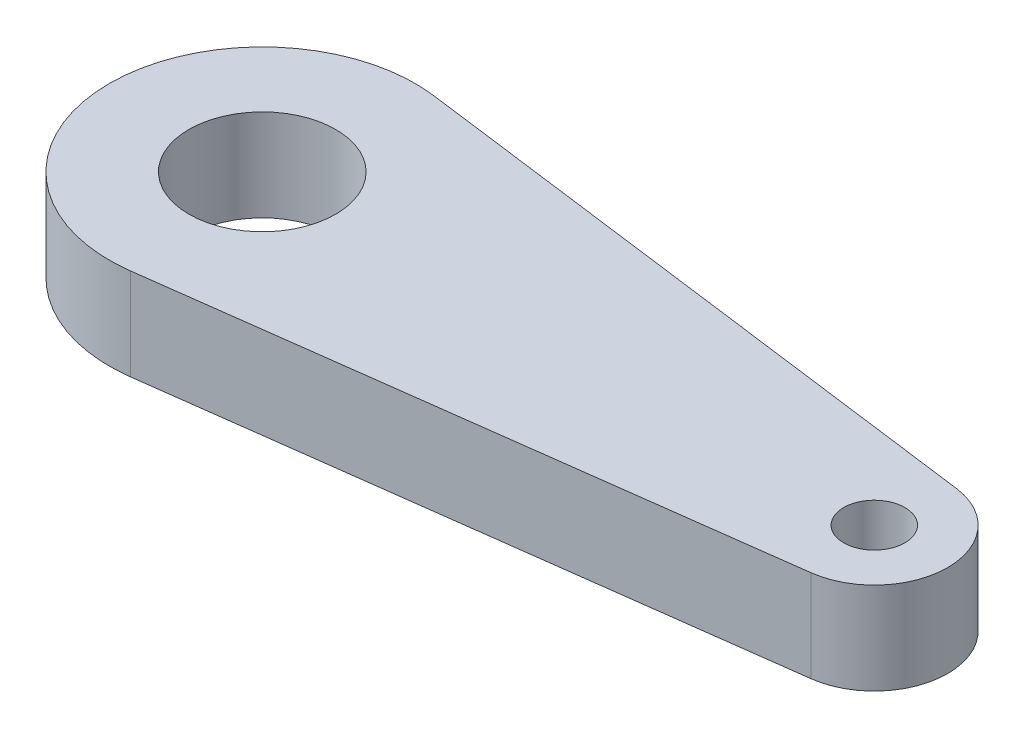
ISO-10303-21;
HEADER;
FILE_DESCRIPTION(('STEP AP214'),'2;1');
FILE_NAME('part.step','',(''),(''),'','','');
FILE_SCHEMA(('AUTOMOTIVE_DESIGN { 1 0 10303 214 1 1 1 1 }'));
ENDSEC;
DATA;
#1=APPLICATION_CONTEXT('core data for automotive mechanical design processes');
#2=APPLICATION_PROTOCOL_DEFINITION('international standard','automotive_design',2000,#1);
#3=PRODUCT_CONTEXT('',#1,'mechanical');
#4=PRODUCT('Part','Part','',(#3));
#5=PRODUCT_RELATED_PRODUCT_CATEGORY('part','',(#4));
#6=PRODUCT_DEFINITION_FORMATION('','',#4);
#7=PRODUCT_DEFINITION_CONTEXT('part definition',#1,'design');
#8=PRODUCT_DEFINITION('design','',#6,#7);
#9=PRODUCT_DEFINITION_SHAPE('','',#8);
#10=(LENGTH_UNIT() NAMED_UNIT(*) SI_UNIT(.MILLI.,.METRE.));
#11=(NAMED_UNIT(*) PLANE_ANGLE_UNIT() SI_UNIT($,.RADIAN.));
#12=(NAMED_UNIT(*) SI_UNIT($,.STERADIAN.) SOLID_ANGLE_UNIT());
#13=UNCERTAINTY_MEASURE_WITH_UNIT(LENGTH_MEASURE(1.E-05),#10,'distance_accuracy_value','');
#14=(GEOMETRIC_REPRESENTATION_CONTEXT(3) GLOBAL_UNCERTAINTY_ASSIGNED_CONTEXT((#13)) GLOBAL_UNIT_ASSIGNED_CONTEXT((#10,
#11,#12)) REPRESENTATION_CONTEXT('',''));
#15=CARTESIAN_POINT('',(0.,0.,0.));
#16=DIRECTION('',(0.,0.,1.));
#17=DIRECTION('',(1.,0.,0.));
#18=AXIS2_PLACEMENT_3D('',#15,#16,#17);
#19=CARTESIAN_POINT('',(-23.9105775527429,7.5,0.));
#20=DIRECTION('',(0.,1.,0.));
#21=DIRECTION('',(0.,0.,1.));
#22=AXIS2_PLACEMENT_3D('',#19,#20,#21);
#23=PLANE('',#22);
#24=CARTESIAN_POINT('',(26.0894224472571,7.5,0.));
#25=DIRECTION('',(0.,1.,0.));
#26=DIRECTION('',(0.,0.,1.));
#27=AXIS2_PLACEMENT_3D('',#24,#25,#26);
#28=CIRCLE('',#27,2.5);
#29=CARTESIAN_POINT('',(26.0894224472571,7.5,2.5));
#30=VERTEX_POINT('',#29);
#31=EDGE_CURVE('E108',#30,#30,#28,.T.);
#32=ORIENTED_EDGE('',*,*,#31,.F.);
#33=EDGE_LOOP('',(#32));
#34=FACE_BOUND('',#33,.T.);
#35=CARTESIAN_POINT('',(-23.9105775527429,7.5,0.));
#36=DIRECTION('',(0.,1.,0.));
#37=DIRECTION('',(0.,0.,1.));
#38=AXIS2_PLACEMENT_3D('',#35,#36,#37);
#39=CIRCLE('',#38,12.5);
#40=CARTESIAN_POINT('',(-22.2855775527429,7.5,-12.3939249231226));
#41=VERTEX_POINT('',#40);
#42=CARTESIAN_POINT('',(-22.2855775527429,7.5,12.3939249231226));
#43=VERTEX_POINT('',#42);
#44=EDGE_CURVE('E93',#41,#43,#39,.T.);
#45=ORIENTED_EDGE('',*,*,#44,.T.);
#46=DIRECTION('',(0.991513993849809,0.,-0.13));
#47=VECTOR('',#46,1.);
#48=CARTESIAN_POINT('',(-22.2855775527429,7.5,12.3939249231226));
#49=LINE('',#48,#47);
#50=CARTESIAN_POINT('',(26.8694224472571,7.5,5.94908396309885));
#51=VERTEX_POINT('',#50);
#52=EDGE_CURVE('E88',#43,#51,#49,.T.);
#53=ORIENTED_EDGE('',*,*,#52,.T.);
#54=CARTESIAN_POINT('',(26.0894224472571,7.5,0.));
#55=DIRECTION('',(0.,1.,0.));
#56=DIRECTION('',(0.,0.,1.));
#57=AXIS2_PLACEMENT_3D('',#54,#55,#56);
#58=CIRCLE('',#57,6.);
#59=CARTESIAN_POINT('',(26.8694224472571,7.5,-5.94908396309885));
#60=VERTEX_POINT('',#59);
#61=EDGE_CURVE('E91',#51,#60,#58,.T.);
#62=ORIENTED_EDGE('',*,*,#61,.T.);
#63=DIRECTION('',(-0.991513993849809,0.,-0.13));
#64=VECTOR('',#63,1.);
#65=CARTESIAN_POINT('',(-22.2855775527429,7.5,-12.3939249231226));
#66=LINE('',#65,#64);
#67=EDGE_CURVE('E58',#60,#41,#66,.T.);
#68=ORIENTED_EDGE('',*,*,#67,.T.);
#69=EDGE_LOOP('',(#45,#53,#62,#68));
#70=FACE_BOUND('',#69,.T.);
#71=CARTESIAN_POINT('',(-23.9105775527429,7.5,0.));
#72=DIRECTION('',(0.,1.,0.));
#73=DIRECTION('',(0.,0.,1.));
#74=AXIS2_PLACEMENT_3D('',#71,#72,#73);
#75=CIRCLE('',#74,6.);
#76=CARTESIAN_POINT('',(-23.9105775527429,7.5,6.));
#77=VERTEX_POINT('',#76);
#78=EDGE_CURVE('E123',#77,#77,#75,.T.);
#79=ORIENTED_EDGE('',*,*,#78,.F.);
#80=EDGE_LOOP('',(#79));
#81=FACE_BOUND('',#80,.T.);
#82=ADVANCED_FACE('F41',(#34,#70,#81),#23,.T.);
#83=CARTESIAN_POINT('',(-23.9105775527429,0.,0.));
#84=DIRECTION('',(0.,1.,0.));
#85=DIRECTION('',(0.,0.,1.));
#86=AXIS2_PLACEMENT_3D('',#83,#84,#85);
#87=PLANE('',#86);
#88=CARTESIAN_POINT('',(-23.9105775527429,0.,0.));
#89=DIRECTION('',(0.,1.,0.));
#90=DIRECTION('',(0.,0.,1.));
#91=AXIS2_PLACEMENT_3D('',#88,#89,#90);
#92=CIRCLE('',#91,12.5);
#93=CARTESIAN_POINT('',(-22.2855775527429,0.,-12.3939249231226));
#94=VERTEX_POINT('',#93);
#95=CARTESIAN_POINT('',(-22.2855775527429,0.,12.3939249231226));
#96=VERTEX_POINT('',#95);
#97=EDGE_CURVE('E105',#94,#96,#92,.T.);
#98=ORIENTED_EDGE('',*,*,#97,.F.);
#99=DIRECTION('',(-0.991513993849809,0.,-0.13));
#100=VECTOR('',#99,1.);
#101=CARTESIAN_POINT('',(-22.2855775527429,0.,-12.3939249231226));
#102=LINE('',#101,#100);
#103=CARTESIAN_POINT('',(26.8694224472571,0.,-5.94908396309885));
#104=VERTEX_POINT('',#103);
#105=EDGE_CURVE('E81',#104,#94,#102,.T.);
#106=ORIENTED_EDGE('',*,*,#105,.F.);
#107=CARTESIAN_POINT('',(26.0894224472571,0.,0.));
#108=DIRECTION('',(0.,1.,0.));
#109=DIRECTION('',(0.,0.,1.));
#110=AXIS2_PLACEMENT_3D('',#107,#108,#109);
#111=CIRCLE('',#110,6.);
#112=CARTESIAN_POINT('',(26.8694224472571,0.,5.94908396309885));
#113=VERTEX_POINT('',#112);
#114=EDGE_CURVE('E75',#113,#104,#111,.T.);
#115=ORIENTED_EDGE('',*,*,#114,.F.);
#116=DIRECTION('',(0.991513993849809,0.,-0.13));
#117=VECTOR('',#116,1.);
#118=CARTESIAN_POINT('',(-22.2855775527429,0.,12.3939249231226));
#119=LINE('',#118,#117);
#120=EDGE_CURVE('E97',#96,#113,#119,.T.);
#121=ORIENTED_EDGE('',*,*,#120,.F.);
#122=EDGE_LOOP('',(#98,#106,#115,#121));
#123=FACE_BOUND('',#122,.T.);
#124=CARTESIAN_POINT('',(26.0894224472571,0.,0.));
#125=DIRECTION('',(0.,1.,0.));
#126=DIRECTION('',(0.,0.,1.));
#127=AXIS2_PLACEMENT_3D('',#124,#125,#126);
#128=CIRCLE('',#127,2.5);
#129=CARTESIAN_POINT('',(26.0894224472571,0.,2.5));
#130=VERTEX_POINT('',#129);
#131=EDGE_CURVE('E120',#130,#130,#128,.T.);
#132=ORIENTED_EDGE('',*,*,#131,.T.);
#133=EDGE_LOOP('',(#132));
#134=FACE_BOUND('',#133,.T.);
#135=CARTESIAN_POINT('',(-23.9105775527429,0.,0.));
#136=DIRECTION('',(0.,1.,0.));
#137=DIRECTION('',(0.,0.,1.));
#138=AXIS2_PLACEMENT_3D('',#135,#136,#137);
#139=CIRCLE('',#138,6.);
#140=CARTESIAN_POINT('',(-23.9105775527429,0.,6.));
#141=VERTEX_POINT('',#140);
#142=EDGE_CURVE('E126',#141,#141,#139,.T.);
#143=ORIENTED_EDGE('',*,*,#142,.T.);
#144=EDGE_LOOP('',(#143));
#145=FACE_BOUND('',#144,.T.);
#146=ADVANCED_FACE('F116',(#123,#134,#145),#87,.F.);
#147=CARTESIAN_POINT('',(-23.9105775527429,7.5,0.));
#148=DIRECTION('',(0.,-1.,0.));
#149=DIRECTION('',(0.,0.,-1.));
#150=AXIS2_PLACEMENT_3D('',#147,#148,#149);
#151=CYLINDRICAL_SURFACE('',#150,12.5);
#152=ORIENTED_EDGE('',*,*,#97,.T.);
#153=DIRECTION('',(0.,-1.,0.));
#154=VECTOR('',#153,1.);
#155=CARTESIAN_POINT('',(-22.2855775527429,7.5,12.3939249231226));
#156=LINE('',#155,#154);
#157=EDGE_CURVE('E11',#43,#96,#156,.T.);
#158=ORIENTED_EDGE('',*,*,#157,.F.);
#159=ORIENTED_EDGE('',*,*,#44,.F.);
#160=DIRECTION('',(0.,-1.,0.));
#161=VECTOR('',#160,1.);
#162=CARTESIAN_POINT('',(-22.2855775527429,7.5,-12.3939249231226));
#163=LINE('',#162,#161);
#164=EDGE_CURVE('E101',#41,#94,#163,.T.);
#165=ORIENTED_EDGE('',*,*,#164,.T.);
#166=EDGE_LOOP('',(#152,#158,#159,#165));
#167=FACE_BOUND('',#166,.T.);
#168=ADVANCED_FACE('F43',(#167),#151,.T.);
#169=CARTESIAN_POINT('',(-22.2855775527429,7.5,12.3939249231226));
#170=DIRECTION('',(-0.13,0.,-0.991513993849809));
#171=DIRECTION('',(-0.99151399384981,0.,0.13));
#172=AXIS2_PLACEMENT_3D('',#169,#170,#171);
#173=PLANE('',#172);
#174=ORIENTED_EDGE('',*,*,#120,.T.);
#175=DIRECTION('',(0.,-1.,0.));
#176=VECTOR('',#175,1.);
#177=CARTESIAN_POINT('',(26.8694224472571,7.5,5.94908396309885));
#178=LINE('',#177,#176);
#179=EDGE_CURVE('E50',#51,#113,#178,.T.);
#180=ORIENTED_EDGE('',*,*,#179,.F.);
#181=ORIENTED_EDGE('',*,*,#52,.F.);
#182=ORIENTED_EDGE('',*,*,#157,.T.);
#183=EDGE_LOOP('',(#174,#180,#181,#182));
#184=FACE_BOUND('',#183,.T.);
#185=ADVANCED_FACE('F96',(#184),#173,.F.);
#186=CARTESIAN_POINT('',(26.0894224472571,7.5,0.));
#187=DIRECTION('',(0.,-1.,0.));
#188=DIRECTION('',(0.,0.,-1.));
#189=AXIS2_PLACEMENT_3D('',#186,#187,#188);
#190=CYLINDRICAL_SURFACE('',#189,6.);
#191=ORIENTED_EDGE('',*,*,#114,.T.);
#192=DIRECTION('',(0.,-1.,0.));
#193=VECTOR('',#192,1.);
#194=CARTESIAN_POINT('',(26.8694224472571,7.5,-5.94908396309885));
#195=LINE('',#194,#193);
#196=EDGE_CURVE('E98',#60,#104,#195,.T.);
#197=ORIENTED_EDGE('',*,*,#196,.F.);
#198=ORIENTED_EDGE('',*,*,#61,.F.);
#199=ORIENTED_EDGE('',*,*,#179,.T.);
#200=EDGE_LOOP('',(#191,#197,#198,#199));
#201=FACE_BOUND('',#200,.T.);
#202=ADVANCED_FACE('F99',(#201),#190,.T.);
#203=CARTESIAN_POINT('',(-22.2855775527429,7.5,-12.3939249231226));
#204=DIRECTION('',(-0.13,0.,0.991513993849809));
#205=DIRECTION('',(0.99151399384981,0.,0.13));
#206=AXIS2_PLACEMENT_3D('',#203,#204,#205);
#207=PLANE('',#206);
#208=ORIENTED_EDGE('',*,*,#105,.T.);
#209=ORIENTED_EDGE('',*,*,#164,.F.);
#210=ORIENTED_EDGE('',*,*,#67,.F.);
#211=ORIENTED_EDGE('',*,*,#196,.T.);
#212=EDGE_LOOP('',(#208,#209,#210,#211));
#213=FACE_BOUND('',#212,.T.);
#214=ADVANCED_FACE('F113',(#213),#207,.F.);
#215=CARTESIAN_POINT('',(26.0894224472571,7.5,0.));
#216=DIRECTION('',(0.,-1.,0.));
#217=DIRECTION('',(0.,0.,-1.));
#218=AXIS2_PLACEMENT_3D('',#215,#216,#217);
#219=CYLINDRICAL_SURFACE('',#218,2.5);
#220=ORIENTED_EDGE('',*,*,#31,.T.);
#221=EDGE_LOOP('',(#220));
#222=FACE_BOUND('',#221,.T.);
#223=ORIENTED_EDGE('',*,*,#131,.F.);
#224=EDGE_LOOP('',(#223));
#225=FACE_BOUND('',#224,.T.);
#226=ADVANCED_FACE('F143',(#222,#225),#219,.F.);
#227=CARTESIAN_POINT('',(-23.9105775527429,7.5,0.));
#228=DIRECTION('',(0.,-1.,0.));
#229=DIRECTION('',(0.,0.,-1.));
#230=AXIS2_PLACEMENT_3D('',#227,#228,#229);
#231=CYLINDRICAL_SURFACE('',#230,6.);
#232=ORIENTED_EDGE('',*,*,#78,.T.);
#233=EDGE_LOOP('',(#232));
#234=FACE_BOUND('',#233,.T.);
#235=ORIENTED_EDGE('',*,*,#142,.F.);
#236=EDGE_LOOP('',(#235));
#237=FACE_BOUND('',#236,.T.);
#238=ADVANCED_FACE('F132',(#234,#237),#231,.F.);
#239=CLOSED_SHELL('',(#82,#146,#168,#185,#202,#214,#226,#238));
#240=MANIFOLD_SOLID_BREP('B2',#239);
#241=ADVANCED_BREP_SHAPE_REPRESENTATION('',(#18,#240),#14);
#242=SHAPE_DEFINITION_REPRESENTATION(#9,#241);
ENDSEC;
END-ISO-10303-21;
